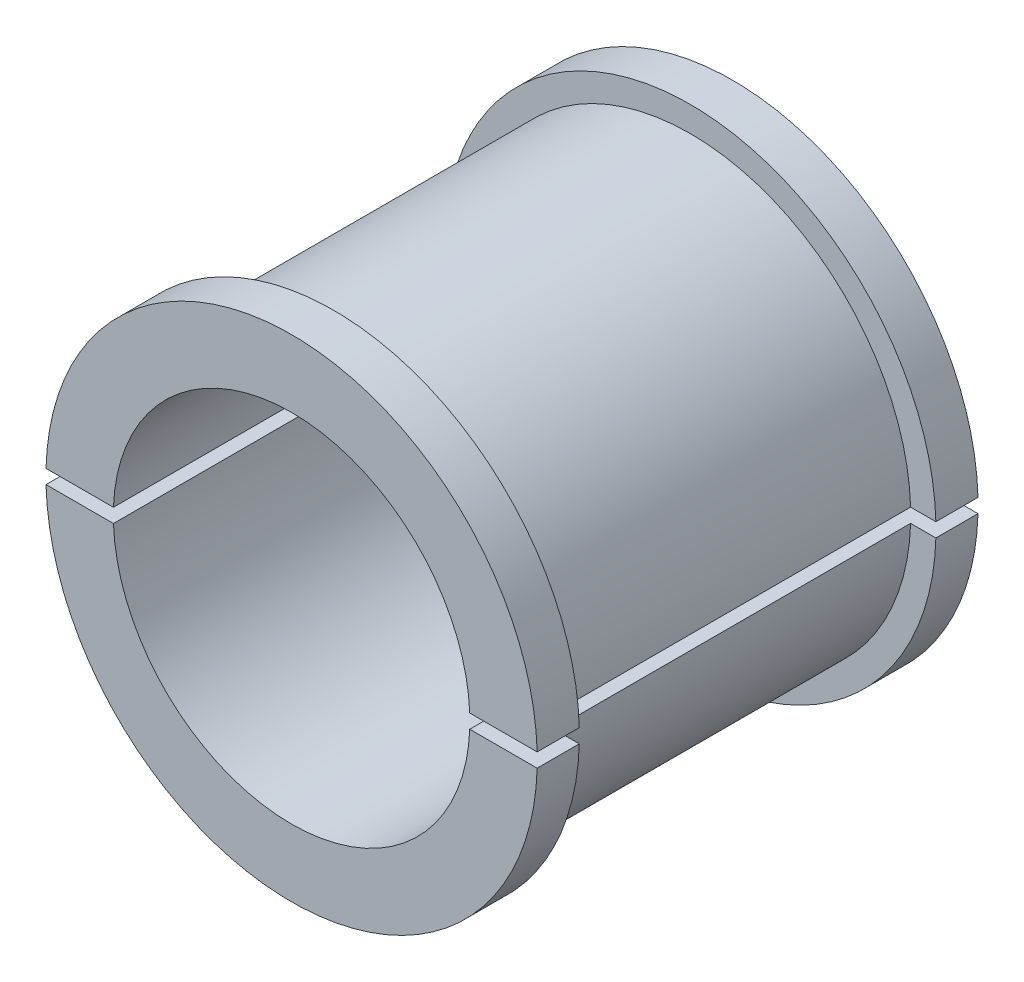
ISO-10303-21;
HEADER;
FILE_DESCRIPTION(('STEP AP214'),'2;1');
FILE_NAME('part.step','',(''),(''),'','','');
FILE_SCHEMA(('AUTOMOTIVE_DESIGN { 1 0 10303 214 1 1 1 1 }'));
ENDSEC;
DATA;
#1=APPLICATION_CONTEXT('core data for automotive mechanical design processes');
#2=APPLICATION_PROTOCOL_DEFINITION('international standard','automotive_design',2000,#1);
#3=PRODUCT_CONTEXT('',#1,'mechanical');
#4=PRODUCT('Part','Part','',(#3));
#5=PRODUCT_RELATED_PRODUCT_CATEGORY('part','',(#4));
#6=PRODUCT_DEFINITION_FORMATION('','',#4);
#7=PRODUCT_DEFINITION_CONTEXT('part definition',#1,'design');
#8=PRODUCT_DEFINITION('design','',#6,#7);
#9=PRODUCT_DEFINITION_SHAPE('','',#8);
#10=(LENGTH_UNIT() NAMED_UNIT(*) SI_UNIT(.MILLI.,.METRE.));
#11=(NAMED_UNIT(*) PLANE_ANGLE_UNIT() SI_UNIT($,.RADIAN.));
#12=(NAMED_UNIT(*) SI_UNIT($,.STERADIAN.) SOLID_ANGLE_UNIT());
#13=UNCERTAINTY_MEASURE_WITH_UNIT(LENGTH_MEASURE(1.E-05),#10,'distance_accuracy_value','');
#14=(GEOMETRIC_REPRESENTATION_CONTEXT(3) GLOBAL_UNCERTAINTY_ASSIGNED_CONTEXT((#13)) GLOBAL_UNIT_ASSIGNED_CONTEXT((#10,
#11,#12)) REPRESENTATION_CONTEXT('',''));
#15=CARTESIAN_POINT('',(0.,0.,0.));
#16=DIRECTION('',(0.,0.,1.));
#17=DIRECTION('',(1.,0.,0.));
#18=AXIS2_PLACEMENT_3D('',#15,#16,#17);
#19=CARTESIAN_POINT('',(0.,0.,67.8563059531985));
#20=DIRECTION('',(0.,0.,1.));
#21=DIRECTION('',(1.,0.,0.));
#22=AXIS2_PLACEMENT_3D('',#19,#20,#21);
#23=CYLINDRICAL_SURFACE('',#22,12.7);
#24=CARTESIAN_POINT('',(0.,0.,15.7));
#25=DIRECTION('',(0.,0.,1.));
#26=DIRECTION('',(1.,0.,0.));
#27=AXIS2_PLACEMENT_3D('',#24,#25,#26);
#28=CIRCLE('',#27,12.7);
#29=CARTESIAN_POINT('',(-12.6901536633722,-0.5,15.7));
#30=VERTEX_POINT('',#29);
#31=CARTESIAN_POINT('',(12.6901536633722,-0.5,15.7));
#32=VERTEX_POINT('',#31);
#33=EDGE_CURVE('E45',#30,#32,#28,.T.);
#34=ORIENTED_EDGE('',*,*,#33,.T.);
#35=DIRECTION('',(0.,0.,1.));
#36=VECTOR('',#35,1.);
#37=CARTESIAN_POINT('',(12.6901536633722,-0.5,67.8563059531985));
#38=LINE('',#37,#36);
#39=CARTESIAN_POINT('',(12.6901536633722,-0.5,-15.7));
#40=VERTEX_POINT('',#39);
#41=EDGE_CURVE('E60',#32,#40,#38,.F.);
#42=ORIENTED_EDGE('',*,*,#41,.T.);
#43=CARTESIAN_POINT('',(0.,0.,-15.7));
#44=DIRECTION('',(0.,0.,1.));
#45=DIRECTION('',(1.,0.,0.));
#46=AXIS2_PLACEMENT_3D('',#43,#44,#45);
#47=CIRCLE('',#46,12.7);
#48=CARTESIAN_POINT('',(-12.6901536633722,-0.5,-15.7));
#49=VERTEX_POINT('',#48);
#50=EDGE_CURVE('E142',#49,#40,#47,.T.);
#51=ORIENTED_EDGE('',*,*,#50,.F.);
#52=DIRECTION('',(0.,0.,1.));
#53=VECTOR('',#52,1.);
#54=CARTESIAN_POINT('',(-12.6901536633722,-0.5,67.8563059531985));
#55=LINE('',#54,#53);
#56=EDGE_CURVE('E161',#49,#30,#55,.T.);
#57=ORIENTED_EDGE('',*,*,#56,.T.);
#58=EDGE_LOOP('',(#34,#42,#51,#57));
#59=FACE_BOUND('',#58,.T.);
#60=ADVANCED_FACE('F42',(#59),#23,.F.);
#61=CARTESIAN_POINT('',(0.,12.7,-15.7));
#62=DIRECTION('',(0.,0.,1.));
#63=DIRECTION('',(1.,0.,0.));
#64=AXIS2_PLACEMENT_3D('',#61,#62,#63);
#65=PLANE('',#64);
#66=CARTESIAN_POINT('',(0.,0.,-15.7));
#67=DIRECTION('',(0.,0.,1.));
#68=DIRECTION('',(1.,0.,0.));
#69=AXIS2_PLACEMENT_3D('',#66,#67,#68);
#70=CIRCLE('',#69,17.5);
#71=CARTESIAN_POINT('',(-17.4928556845359,-0.5,-15.7));
#72=VERTEX_POINT('',#71);
#73=CARTESIAN_POINT('',(17.4928556845359,-0.5,-15.7));
#74=VERTEX_POINT('',#73);
#75=EDGE_CURVE('E137',#72,#74,#70,.T.);
#76=ORIENTED_EDGE('',*,*,#75,.F.);
#77=DIRECTION('',(1.,0.,0.));
#78=VECTOR('',#77,1.);
#79=CARTESIAN_POINT('',(-21.0347725952142,-0.5,-15.7));
#80=LINE('',#79,#78);
#81=EDGE_CURVE('E145',#72,#49,#80,.T.);
#82=ORIENTED_EDGE('',*,*,#81,.T.);
#83=ORIENTED_EDGE('',*,*,#50,.T.);
#84=EDGE_CURVE('E141',#40,#74,#80,.T.);
#85=ORIENTED_EDGE('',*,*,#84,.T.);
#86=EDGE_LOOP('',(#76,#82,#83,#85));
#87=FACE_BOUND('',#86,.T.);
#88=ADVANCED_FACE('F184',(#87),#65,.F.);
#89=CARTESIAN_POINT('',(0.,0.,67.8563059531985));
#90=DIRECTION('',(0.,0.,1.));
#91=DIRECTION('',(1.,0.,0.));
#92=AXIS2_PLACEMENT_3D('',#89,#90,#91);
#93=CYLINDRICAL_SURFACE('',#92,17.5);
#94=ORIENTED_EDGE('',*,*,#75,.T.);
#95=DIRECTION('',(0.,0.,1.));
#96=VECTOR('',#95,1.);
#97=CARTESIAN_POINT('',(17.4928556845359,-0.5,67.8563059531985));
#98=LINE('',#97,#96);
#99=CARTESIAN_POINT('',(17.4928556845359,-0.5,-12.7));
#100=VERTEX_POINT('',#99);
#101=EDGE_CURVE('E140',#74,#100,#98,.T.);
#102=ORIENTED_EDGE('',*,*,#101,.T.);
#103=CARTESIAN_POINT('',(0.,0.,-12.7));
#104=DIRECTION('',(0.,0.,1.));
#105=DIRECTION('',(1.,0.,0.));
#106=AXIS2_PLACEMENT_3D('',#103,#104,#105);
#107=CIRCLE('',#106,17.5);
#108=CARTESIAN_POINT('',(-17.4928556845359,-0.5,-12.7));
#109=VERTEX_POINT('',#108);
#110=EDGE_CURVE('E132',#109,#100,#107,.T.);
#111=ORIENTED_EDGE('',*,*,#110,.F.);
#112=DIRECTION('',(0.,0.,1.));
#113=VECTOR('',#112,1.);
#114=CARTESIAN_POINT('',(-17.4928556845359,-0.5,67.8563059531985));
#115=LINE('',#114,#113);
#116=EDGE_CURVE('E136',#109,#72,#115,.F.);
#117=ORIENTED_EDGE('',*,*,#116,.T.);
#118=EDGE_LOOP('',(#94,#102,#111,#117));
#119=FACE_BOUND('',#118,.T.);
#120=ADVANCED_FACE('F180',(#119),#93,.T.);
#121=CARTESIAN_POINT('',(0.,17.5,-12.7));
#122=DIRECTION('',(0.,0.,-1.));
#123=DIRECTION('',(-1.,0.,0.));
#124=AXIS2_PLACEMENT_3D('',#121,#122,#123);
#125=PLANE('',#124);
#126=ORIENTED_EDGE('',*,*,#110,.T.);
#127=DIRECTION('',(-1.,0.,0.));
#128=VECTOR('',#127,1.);
#129=CARTESIAN_POINT('',(0.,-0.5,-12.7));
#130=LINE('',#129,#128);
#131=CARTESIAN_POINT('',(15.6920361967464,-0.5,-12.7));
#132=VERTEX_POINT('',#131);
#133=EDGE_CURVE('E135',#100,#132,#130,.T.);
#134=ORIENTED_EDGE('',*,*,#133,.T.);
#135=CARTESIAN_POINT('',(0.,0.,-12.7));
#136=DIRECTION('',(0.,0.,1.));
#137=DIRECTION('',(1.,0.,0.));
#138=AXIS2_PLACEMENT_3D('',#135,#136,#137);
#139=CIRCLE('',#138,15.7);
#140=CARTESIAN_POINT('',(-15.6920361967464,-0.5,-12.7));
#141=VERTEX_POINT('',#140);
#142=EDGE_CURVE('E127',#141,#132,#139,.T.);
#143=ORIENTED_EDGE('',*,*,#142,.F.);
#144=EDGE_CURVE('E131',#141,#109,#130,.T.);
#145=ORIENTED_EDGE('',*,*,#144,.T.);
#146=EDGE_LOOP('',(#126,#134,#143,#145));
#147=FACE_BOUND('',#146,.T.);
#148=ADVANCED_FACE('F177',(#147),#125,.F.);
#149=CARTESIAN_POINT('',(0.,0.,67.8563059531985));
#150=DIRECTION('',(0.,0.,1.));
#151=DIRECTION('',(1.,0.,0.));
#152=AXIS2_PLACEMENT_3D('',#149,#150,#151);
#153=CYLINDRICAL_SURFACE('',#152,15.7);
#154=ORIENTED_EDGE('',*,*,#142,.T.);
#155=DIRECTION('',(0.,0.,1.));
#156=VECTOR('',#155,1.);
#157=CARTESIAN_POINT('',(15.6920361967464,-0.5,67.8563059531985));
#158=LINE('',#157,#156);
#159=CARTESIAN_POINT('',(15.6920361967464,-0.5,12.7));
#160=VERTEX_POINT('',#159);
#161=EDGE_CURVE('E130',#132,#160,#158,.T.);
#162=ORIENTED_EDGE('',*,*,#161,.T.);
#163=CARTESIAN_POINT('',(0.,0.,12.7));
#164=DIRECTION('',(0.,0.,1.));
#165=DIRECTION('',(1.,0.,0.));
#166=AXIS2_PLACEMENT_3D('',#163,#164,#165);
#167=CIRCLE('',#166,15.7);
#168=CARTESIAN_POINT('',(-15.6920361967464,-0.5,12.7));
#169=VERTEX_POINT('',#168);
#170=EDGE_CURVE('E123',#169,#160,#167,.T.);
#171=ORIENTED_EDGE('',*,*,#170,.F.);
#172=DIRECTION('',(0.,0.,1.));
#173=VECTOR('',#172,1.);
#174=CARTESIAN_POINT('',(-15.6920361967464,-0.5,67.8563059531985));
#175=LINE('',#174,#173);
#176=EDGE_CURVE('E150',#169,#141,#175,.F.);
#177=ORIENTED_EDGE('',*,*,#176,.T.);
#178=EDGE_LOOP('',(#154,#162,#171,#177));
#179=FACE_BOUND('',#178,.T.);
#180=ADVANCED_FACE('F174',(#179),#153,.T.);
#181=CARTESIAN_POINT('',(0.,17.5,12.7));
#182=DIRECTION('',(0.,0.,1.));
#183=DIRECTION('',(1.,0.,0.));
#184=AXIS2_PLACEMENT_3D('',#181,#182,#183);
#185=PLANE('',#184);
#186=CARTESIAN_POINT('',(0.,0.,12.7));
#187=DIRECTION('',(0.,0.,1.));
#188=DIRECTION('',(1.,0.,0.));
#189=AXIS2_PLACEMENT_3D('',#186,#187,#188);
#190=CIRCLE('',#189,17.5);
#191=CARTESIAN_POINT('',(-17.4928556845359,-0.5,12.7));
#192=VERTEX_POINT('',#191);
#193=CARTESIAN_POINT('',(17.4928556845359,-0.5,12.7));
#194=VERTEX_POINT('',#193);
#195=EDGE_CURVE('E114',#192,#194,#190,.T.);
#196=ORIENTED_EDGE('',*,*,#195,.F.);
#197=DIRECTION('',(1.,0.,0.));
#198=VECTOR('',#197,1.);
#199=CARTESIAN_POINT('',(0.,-0.5,12.7));
#200=LINE('',#199,#198);
#201=EDGE_CURVE('E126',#192,#169,#200,.T.);
#202=ORIENTED_EDGE('',*,*,#201,.T.);
#203=ORIENTED_EDGE('',*,*,#170,.T.);
#204=EDGE_CURVE('E122',#160,#194,#200,.T.);
#205=ORIENTED_EDGE('',*,*,#204,.T.);
#206=EDGE_LOOP('',(#196,#202,#203,#205));
#207=FACE_BOUND('',#206,.T.);
#208=ADVANCED_FACE('F170',(#207),#185,.F.);
#209=CARTESIAN_POINT('',(0.,0.,67.8563059531985));
#210=DIRECTION('',(0.,0.,1.));
#211=DIRECTION('',(1.,0.,0.));
#212=AXIS2_PLACEMENT_3D('',#209,#210,#211);
#213=CYLINDRICAL_SURFACE('',#212,17.5);
#214=ORIENTED_EDGE('',*,*,#195,.T.);
#215=DIRECTION('',(0.,0.,1.));
#216=VECTOR('',#215,1.);
#217=CARTESIAN_POINT('',(17.4928556845359,-0.5,67.8563059531985));
#218=LINE('',#217,#216);
#219=CARTESIAN_POINT('',(17.4928556845359,-0.5,15.7));
#220=VERTEX_POINT('',#219);
#221=EDGE_CURVE('E101',#194,#220,#218,.T.);
#222=ORIENTED_EDGE('',*,*,#221,.T.);
#223=CARTESIAN_POINT('',(0.,0.,15.7));
#224=DIRECTION('',(0.,0.,1.));
#225=DIRECTION('',(1.,0.,0.));
#226=AXIS2_PLACEMENT_3D('',#223,#224,#225);
#227=CIRCLE('',#226,17.5);
#228=CARTESIAN_POINT('',(-17.4928556845359,-0.5,15.7));
#229=VERTEX_POINT('',#228);
#230=EDGE_CURVE('E107',#229,#220,#227,.T.);
#231=ORIENTED_EDGE('',*,*,#230,.F.);
#232=DIRECTION('',(0.,0.,1.));
#233=VECTOR('',#232,1.);
#234=CARTESIAN_POINT('',(-17.4928556845359,-0.5,67.8563059531985));
#235=LINE('',#234,#233);
#236=EDGE_CURVE('E115',#229,#192,#235,.F.);
#237=ORIENTED_EDGE('',*,*,#236,.T.);
#238=EDGE_LOOP('',(#214,#222,#231,#237));
#239=FACE_BOUND('',#238,.T.);
#240=ADVANCED_FACE('F111',(#239),#213,.T.);
#241=CARTESIAN_POINT('',(0.,12.7,15.7));
#242=DIRECTION('',(0.,0.,-1.));
#243=DIRECTION('',(-1.,0.,0.));
#244=AXIS2_PLACEMENT_3D('',#241,#242,#243);
#245=PLANE('',#244);
#246=ORIENTED_EDGE('',*,*,#230,.T.);
#247=DIRECTION('',(-1.,0.,0.));
#248=VECTOR('',#247,1.);
#249=CARTESIAN_POINT('',(0.,-0.5,15.7));
#250=LINE('',#249,#248);
#251=EDGE_CURVE('E51',#220,#32,#250,.T.);
#252=ORIENTED_EDGE('',*,*,#251,.T.);
#253=ORIENTED_EDGE('',*,*,#33,.F.);
#254=EDGE_CURVE('E12',#30,#229,#250,.T.);
#255=ORIENTED_EDGE('',*,*,#254,.T.);
#256=EDGE_LOOP('',(#246,#252,#253,#255));
#257=FACE_BOUND('',#256,.T.);
#258=ADVANCED_FACE('F117',(#257),#245,.F.);
#259=CARTESIAN_POINT('',(-21.0347725952142,-0.5,-15.7));
#260=DIRECTION('',(0.,-1.,0.));
#261=DIRECTION('',(0.,0.,-1.));
#262=AXIS2_PLACEMENT_3D('',#259,#260,#261);
#263=PLANE('',#262);
#264=ORIENTED_EDGE('',*,*,#81,.F.);
#265=ORIENTED_EDGE('',*,*,#116,.F.);
#266=ORIENTED_EDGE('',*,*,#144,.F.);
#267=ORIENTED_EDGE('',*,*,#176,.F.);
#268=ORIENTED_EDGE('',*,*,#201,.F.);
#269=ORIENTED_EDGE('',*,*,#236,.F.);
#270=ORIENTED_EDGE('',*,*,#254,.F.);
#271=ORIENTED_EDGE('',*,*,#56,.F.);
#272=EDGE_LOOP('',(#264,#265,#266,#267,#268,#269,#270,#271));
#273=FACE_BOUND('',#272,.T.);
#274=ADVANCED_FACE('F168',(#273),#263,.F.);
#275=ORIENTED_EDGE('',*,*,#251,.F.);
#276=ORIENTED_EDGE('',*,*,#221,.F.);
#277=ORIENTED_EDGE('',*,*,#204,.F.);
#278=ORIENTED_EDGE('',*,*,#161,.F.);
#279=ORIENTED_EDGE('',*,*,#133,.F.);
#280=ORIENTED_EDGE('',*,*,#101,.F.);
#281=ORIENTED_EDGE('',*,*,#84,.F.);
#282=ORIENTED_EDGE('',*,*,#41,.F.);
#283=EDGE_LOOP('',(#275,#276,#277,#278,#279,#280,#281,#282));
#284=FACE_BOUND('',#283,.T.);
#285=ADVANCED_FACE('F100',(#284),#263,.F.);
#286=CLOSED_SHELL('',(#60,#88,#120,#148,#180,#208,#240,#258,#274,#285));
#287=MANIFOLD_SOLID_BREP('B2',#286);
#288=CARTESIAN_POINT('',(0.,12.7,15.7));
#289=DIRECTION('',(0.,0.,-1.));
#290=DIRECTION('',(-1.,0.,0.));
#291=AXIS2_PLACEMENT_3D('',#288,#289,#290);
#292=PLANE('',#291);
#293=CARTESIAN_POINT('',(0.,0.,15.7));
#294=DIRECTION('',(0.,0.,1.));
#295=DIRECTION('',(1.,0.,0.));
#296=AXIS2_PLACEMENT_3D('',#293,#294,#295);
#297=CIRCLE('',#296,17.5);
#298=CARTESIAN_POINT('',(17.4928556845359,0.5,15.7));
#299=VERTEX_POINT('',#298);
#300=CARTESIAN_POINT('',(-17.4928556845359,0.5,15.7));
#301=VERTEX_POINT('',#300);
#302=EDGE_CURVE('E341',#299,#301,#297,.T.);
#303=ORIENTED_EDGE('',*,*,#302,.T.);
#304=DIRECTION('',(1.,0.,0.));
#305=VECTOR('',#304,1.);
#306=CARTESIAN_POINT('',(0.,0.5,15.7));
#307=LINE('',#306,#305);
#308=CARTESIAN_POINT('',(-12.6901536633722,0.5,15.7));
#309=VERTEX_POINT('',#308);
#310=EDGE_CURVE('E40',#301,#309,#307,.T.);
#311=ORIENTED_EDGE('',*,*,#310,.T.);
#312=CARTESIAN_POINT('',(0.,0.,15.7));
#313=DIRECTION('',(0.,0.,1.));
#314=DIRECTION('',(1.,0.,0.));
#315=AXIS2_PLACEMENT_3D('',#312,#313,#314);
#316=CIRCLE('',#315,12.7);
#317=CARTESIAN_POINT('',(12.6901536633722,0.5,15.7));
#318=VERTEX_POINT('',#317);
#319=EDGE_CURVE('E337',#318,#309,#316,.T.);
#320=ORIENTED_EDGE('',*,*,#319,.F.);
#321=EDGE_CURVE('E268',#318,#299,#307,.T.);
#322=ORIENTED_EDGE('',*,*,#321,.T.);
#323=EDGE_LOOP('',(#303,#311,#320,#322));
#324=FACE_BOUND('',#323,.T.);
#325=ADVANCED_FACE('F264',(#324),#292,.F.);
#326=CARTESIAN_POINT('',(0.,0.,67.8563059531985));
#327=DIRECTION('',(0.,0.,1.));
#328=DIRECTION('',(1.,0.,0.));
#329=AXIS2_PLACEMENT_3D('',#326,#327,#328);
#330=CYLINDRICAL_SURFACE('',#329,17.5);
#331=CARTESIAN_POINT('',(0.,0.,12.7));
#332=DIRECTION('',(0.,0.,1.));
#333=DIRECTION('',(1.,0.,0.));
#334=AXIS2_PLACEMENT_3D('',#331,#332,#333);
#335=CIRCLE('',#334,17.5);
#336=CARTESIAN_POINT('',(17.4928556845359,0.5,12.7));
#337=VERTEX_POINT('',#336);
#338=CARTESIAN_POINT('',(-17.4928556845359,0.5,12.7));
#339=VERTEX_POINT('',#338);
#340=EDGE_CURVE('E343',#337,#339,#335,.T.);
#341=ORIENTED_EDGE('',*,*,#340,.T.);
#342=DIRECTION('',(0.,0.,1.));
#343=VECTOR('',#342,1.);
#344=CARTESIAN_POINT('',(-17.4928556845359,0.5,67.8563059531985));
#345=LINE('',#344,#343);
#346=EDGE_CURVE('E383',#339,#301,#345,.T.);
#347=ORIENTED_EDGE('',*,*,#346,.T.);
#348=ORIENTED_EDGE('',*,*,#302,.F.);
#349=DIRECTION('',(0.,0.,1.));
#350=VECTOR('',#349,1.);
#351=CARTESIAN_POINT('',(17.4928556845359,0.5,67.8563059531985));
#352=LINE('',#351,#350);
#353=EDGE_CURVE('E279',#299,#337,#352,.F.);
#354=ORIENTED_EDGE('',*,*,#353,.T.);
#355=EDGE_LOOP('',(#341,#347,#348,#354));
#356=FACE_BOUND('',#355,.T.);
#357=ADVANCED_FACE('F404',(#356),#330,.T.);
#358=CARTESIAN_POINT('',(0.,17.5,12.7));
#359=DIRECTION('',(0.,0.,1.));
#360=DIRECTION('',(1.,0.,0.));
#361=AXIS2_PLACEMENT_3D('',#358,#359,#360);
#362=PLANE('',#361);
#363=ORIENTED_EDGE('',*,*,#340,.F.);
#364=DIRECTION('',(-1.,0.,0.));
#365=VECTOR('',#364,1.);
#366=CARTESIAN_POINT('',(0.,0.5,12.7));
#367=LINE('',#366,#365);
#368=CARTESIAN_POINT('',(15.6920361967464,0.5,12.7));
#369=VERTEX_POINT('',#368);
#370=EDGE_CURVE('E368',#337,#369,#367,.T.);
#371=ORIENTED_EDGE('',*,*,#370,.T.);
#372=CARTESIAN_POINT('',(0.,0.,12.7));
#373=DIRECTION('',(0.,0.,1.));
#374=DIRECTION('',(1.,0.,0.));
#375=AXIS2_PLACEMENT_3D('',#372,#373,#374);
#376=CIRCLE('',#375,15.7);
#377=CARTESIAN_POINT('',(-15.6920361967464,0.5,12.7));
#378=VERTEX_POINT('',#377);
#379=EDGE_CURVE('E349',#369,#378,#376,.T.);
#380=ORIENTED_EDGE('',*,*,#379,.T.);
#381=EDGE_CURVE('E374',#378,#339,#367,.T.);
#382=ORIENTED_EDGE('',*,*,#381,.T.);
#383=EDGE_LOOP('',(#363,#371,#380,#382));
#384=FACE_BOUND('',#383,.T.);
#385=ADVANCED_FACE('F401',(#384),#362,.F.);
#386=CARTESIAN_POINT('',(0.,0.,67.8563059531985));
#387=DIRECTION('',(0.,0.,1.));
#388=DIRECTION('',(1.,0.,0.));
#389=AXIS2_PLACEMENT_3D('',#386,#387,#388);
#390=CYLINDRICAL_SURFACE('',#389,15.7);
#391=CARTESIAN_POINT('',(0.,0.,-12.7));
#392=DIRECTION('',(0.,0.,1.));
#393=DIRECTION('',(1.,0.,0.));
#394=AXIS2_PLACEMENT_3D('',#391,#392,#393);
#395=CIRCLE('',#394,15.7);
#396=CARTESIAN_POINT('',(15.6920361967464,0.5,-12.7));
#397=VERTEX_POINT('',#396);
#398=CARTESIAN_POINT('',(-15.6920361967464,0.5,-12.7));
#399=VERTEX_POINT('',#398);
#400=EDGE_CURVE('E352',#397,#399,#395,.T.);
#401=ORIENTED_EDGE('',*,*,#400,.T.);
#402=DIRECTION('',(0.,0.,1.));
#403=VECTOR('',#402,1.);
#404=CARTESIAN_POINT('',(-15.6920361967464,0.5,67.8563059531985));
#405=LINE('',#404,#403);
#406=EDGE_CURVE('E386',#399,#378,#405,.T.);
#407=ORIENTED_EDGE('',*,*,#406,.T.);
#408=ORIENTED_EDGE('',*,*,#379,.F.);
#409=DIRECTION('',(0.,0.,1.));
#410=VECTOR('',#409,1.);
#411=CARTESIAN_POINT('',(15.6920361967464,0.5,67.8563059531985));
#412=LINE('',#411,#410);
#413=EDGE_CURVE('E373',#369,#397,#412,.F.);
#414=ORIENTED_EDGE('',*,*,#413,.T.);
#415=EDGE_LOOP('',(#401,#407,#408,#414));
#416=FACE_BOUND('',#415,.T.);
#417=ADVANCED_FACE('F397',(#416),#390,.T.);
#418=CARTESIAN_POINT('',(0.,17.5,-12.7));
#419=DIRECTION('',(0.,0.,-1.));
#420=DIRECTION('',(-1.,0.,0.));
#421=AXIS2_PLACEMENT_3D('',#418,#419,#420);
#422=PLANE('',#421);
#423=CARTESIAN_POINT('',(0.,0.,-12.7));
#424=DIRECTION('',(0.,0.,1.));
#425=DIRECTION('',(1.,0.,0.));
#426=AXIS2_PLACEMENT_3D('',#423,#424,#425);
#427=CIRCLE('',#426,17.5);
#428=CARTESIAN_POINT('',(17.4928556845359,0.5,-12.7));
#429=VERTEX_POINT('',#428);
#430=CARTESIAN_POINT('',(-17.4928556845359,0.5,-12.7));
#431=VERTEX_POINT('',#430);
#432=EDGE_CURVE('E355',#429,#431,#427,.T.);
#433=ORIENTED_EDGE('',*,*,#432,.T.);
#434=DIRECTION('',(1.,0.,0.));
#435=VECTOR('',#434,1.);
#436=CARTESIAN_POINT('',(0.,0.5,-12.7));
#437=LINE('',#436,#435);
#438=EDGE_CURVE('E381',#431,#399,#437,.T.);
#439=ORIENTED_EDGE('',*,*,#438,.T.);
#440=ORIENTED_EDGE('',*,*,#400,.F.);
#441=EDGE_CURVE('E377',#397,#429,#437,.T.);
#442=ORIENTED_EDGE('',*,*,#441,.T.);
#443=EDGE_LOOP('',(#433,#439,#440,#442));
#444=FACE_BOUND('',#443,.T.);
#445=ADVANCED_FACE('F395',(#444),#422,.F.);
#446=CARTESIAN_POINT('',(0.,0.,67.8563059531985));
#447=DIRECTION('',(0.,0.,1.));
#448=DIRECTION('',(1.,0.,0.));
#449=AXIS2_PLACEMENT_3D('',#446,#447,#448);
#450=CYLINDRICAL_SURFACE('',#449,17.5);
#451=CARTESIAN_POINT('',(0.,0.,-15.7));
#452=DIRECTION('',(0.,0.,1.));
#453=DIRECTION('',(1.,0.,0.));
#454=AXIS2_PLACEMENT_3D('',#451,#452,#453);
#455=CIRCLE('',#454,17.5);
#456=CARTESIAN_POINT('',(17.4928556845359,0.5,-15.7));
#457=VERTEX_POINT('',#456);
#458=CARTESIAN_POINT('',(-17.4928556845359,0.5,-15.7));
#459=VERTEX_POINT('',#458);
#460=EDGE_CURVE('E358',#457,#459,#455,.T.);
#461=ORIENTED_EDGE('',*,*,#460,.T.);
#462=DIRECTION('',(0.,0.,1.));
#463=VECTOR('',#462,1.);
#464=CARTESIAN_POINT('',(-17.4928556845359,0.5,67.8563059531985));
#465=LINE('',#464,#463);
#466=EDGE_CURVE('E339',#459,#431,#465,.T.);
#467=ORIENTED_EDGE('',*,*,#466,.T.);
#468=ORIENTED_EDGE('',*,*,#432,.F.);
#469=DIRECTION('',(0.,0.,1.));
#470=VECTOR('',#469,1.);
#471=CARTESIAN_POINT('',(17.4928556845359,0.5,67.8563059531985));
#472=LINE('',#471,#470);
#473=EDGE_CURVE('E380',#429,#457,#472,.F.);
#474=ORIENTED_EDGE('',*,*,#473,.T.);
#475=EDGE_LOOP('',(#461,#467,#468,#474));
#476=FACE_BOUND('',#475,.T.);
#477=ADVANCED_FACE('F424',(#476),#450,.T.);
#478=CARTESIAN_POINT('',(0.,12.7,-15.7));
#479=DIRECTION('',(0.,0.,1.));
#480=DIRECTION('',(1.,0.,0.));
#481=AXIS2_PLACEMENT_3D('',#478,#479,#480);
#482=PLANE('',#481);
#483=ORIENTED_EDGE('',*,*,#460,.F.);
#484=DIRECTION('',(-1.,0.,0.));
#485=VECTOR('',#484,1.);
#486=CARTESIAN_POINT('',(-21.0347725952142,0.5,-15.7));
#487=LINE('',#486,#485);
#488=CARTESIAN_POINT('',(12.6901536633722,0.5,-15.7));
#489=VERTEX_POINT('',#488);
#490=EDGE_CURVE('E365',#457,#489,#487,.T.);
#491=ORIENTED_EDGE('',*,*,#490,.T.);
#492=CARTESIAN_POINT('',(0.,0.,-15.7));
#493=DIRECTION('',(0.,0.,1.));
#494=DIRECTION('',(1.,0.,0.));
#495=AXIS2_PLACEMENT_3D('',#492,#493,#494);
#496=CIRCLE('',#495,12.7);
#497=CARTESIAN_POINT('',(-12.6901536633722,0.5,-15.7));
#498=VERTEX_POINT('',#497);
#499=EDGE_CURVE('E333',#489,#498,#496,.T.);
#500=ORIENTED_EDGE('',*,*,#499,.T.);
#501=EDGE_CURVE('E364',#498,#459,#487,.T.);
#502=ORIENTED_EDGE('',*,*,#501,.T.);
#503=EDGE_LOOP('',(#483,#491,#500,#502));
#504=FACE_BOUND('',#503,.T.);
#505=ADVANCED_FACE('F363',(#504),#482,.F.);
#506=CARTESIAN_POINT('',(0.,0.,67.8563059531985));
#507=DIRECTION('',(0.,0.,1.));
#508=DIRECTION('',(1.,0.,0.));
#509=AXIS2_PLACEMENT_3D('',#506,#507,#508);
#510=CYLINDRICAL_SURFACE('',#509,12.7);
#511=ORIENTED_EDGE('',*,*,#319,.T.);
#512=DIRECTION('',(0.,0.,1.));
#513=VECTOR('',#512,1.);
#514=CARTESIAN_POINT('',(-12.6901536633722,0.5,67.8563059531985));
#515=LINE('',#514,#513);
#516=EDGE_CURVE('E287',#309,#498,#515,.F.);
#517=ORIENTED_EDGE('',*,*,#516,.T.);
#518=ORIENTED_EDGE('',*,*,#499,.F.);
#519=DIRECTION('',(0.,0.,1.));
#520=VECTOR('',#519,1.);
#521=CARTESIAN_POINT('',(12.6901536633722,0.5,67.8563059531985));
#522=LINE('',#521,#520);
#523=EDGE_CURVE('E327',#489,#318,#522,.T.);
#524=ORIENTED_EDGE('',*,*,#523,.T.);
#525=EDGE_LOOP('',(#511,#517,#518,#524));
#526=FACE_BOUND('',#525,.T.);
#527=ADVANCED_FACE('F266',(#526),#510,.F.);
#528=CARTESIAN_POINT('',(-21.0347725952142,0.5,-15.7));
#529=DIRECTION('',(0.,1.,0.));
#530=DIRECTION('',(0.,0.,1.));
#531=AXIS2_PLACEMENT_3D('',#528,#529,#530);
#532=PLANE('',#531);
#533=ORIENTED_EDGE('',*,*,#490,.F.);
#534=ORIENTED_EDGE('',*,*,#473,.F.);
#535=ORIENTED_EDGE('',*,*,#441,.F.);
#536=ORIENTED_EDGE('',*,*,#413,.F.);
#537=ORIENTED_EDGE('',*,*,#370,.F.);
#538=ORIENTED_EDGE('',*,*,#353,.F.);
#539=ORIENTED_EDGE('',*,*,#321,.F.);
#540=ORIENTED_EDGE('',*,*,#523,.F.);
#541=EDGE_LOOP('',(#533,#534,#535,#536,#537,#538,#539,#540));
#542=FACE_BOUND('',#541,.T.);
#543=ADVANCED_FACE('F326',(#542),#532,.F.);
#544=ORIENTED_EDGE('',*,*,#310,.F.);
#545=ORIENTED_EDGE('',*,*,#346,.F.);
#546=ORIENTED_EDGE('',*,*,#381,.F.);
#547=ORIENTED_EDGE('',*,*,#406,.F.);
#548=ORIENTED_EDGE('',*,*,#438,.F.);
#549=ORIENTED_EDGE('',*,*,#466,.F.);
#550=ORIENTED_EDGE('',*,*,#501,.F.);
#551=ORIENTED_EDGE('',*,*,#516,.F.);
#552=EDGE_LOOP('',(#544,#545,#546,#547,#548,#549,#550,#551));
#553=FACE_BOUND('',#552,.T.);
#554=ADVANCED_FACE('F405',(#553),#532,.F.);
#555=CLOSED_SHELL('',(#325,#357,#385,#417,#445,#477,#505,#527,#543,#554));
#556=MANIFOLD_SOLID_BREP('B6',#555);
#557=ADVANCED_BREP_SHAPE_REPRESENTATION('',(#18,#287,#556),#14);
#558=SHAPE_DEFINITION_REPRESENTATION(#9,#557);
ENDSEC;
END-ISO-10303-21;
